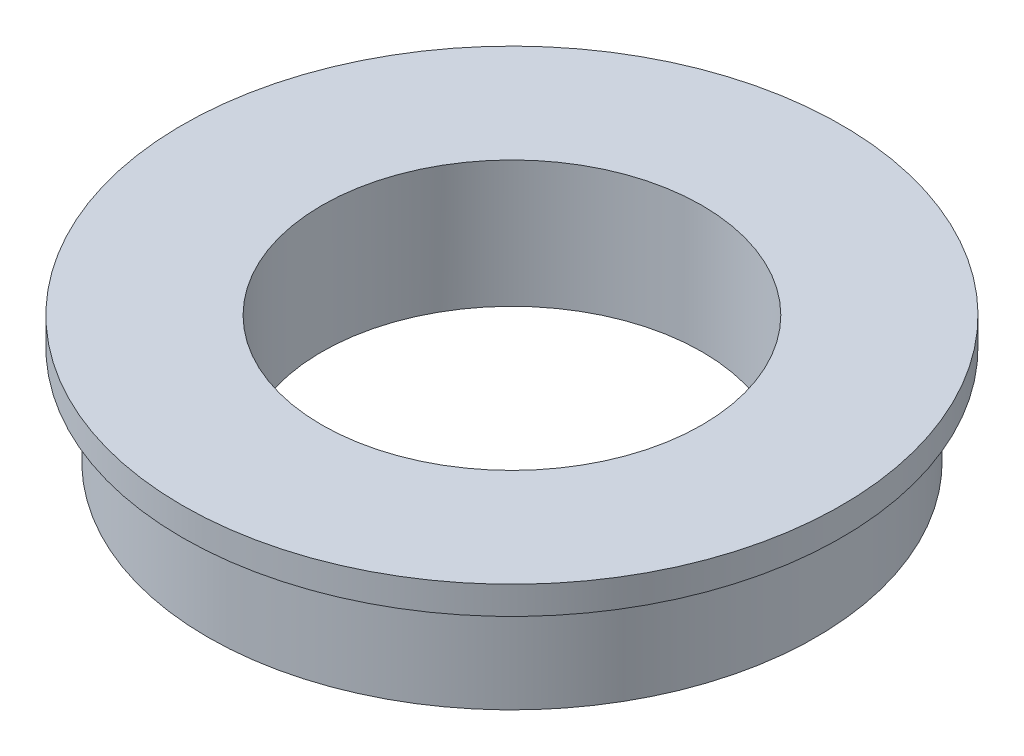
ISO-10303-21;
HEADER;
FILE_DESCRIPTION(('STEP AP214'),'2;1');
FILE_NAME('part.step','',(''),(''),'','','');
FILE_SCHEMA(('AUTOMOTIVE_DESIGN { 1 0 10303 214 1 1 1 1 }'));
ENDSEC;
DATA;
#1=APPLICATION_CONTEXT('core data for automotive mechanical design processes');
#2=APPLICATION_PROTOCOL_DEFINITION('international standard','automotive_design',2000,#1);
#3=PRODUCT_CONTEXT('',#1,'mechanical');
#4=PRODUCT('Part','Part','',(#3));
#5=PRODUCT_RELATED_PRODUCT_CATEGORY('part','',(#4));
#6=PRODUCT_DEFINITION_FORMATION('','',#4);
#7=PRODUCT_DEFINITION_CONTEXT('part definition',#1,'design');
#8=PRODUCT_DEFINITION('design','',#6,#7);
#9=PRODUCT_DEFINITION_SHAPE('','',#8);
#10=(LENGTH_UNIT() NAMED_UNIT(*) SI_UNIT(.MILLI.,.METRE.));
#11=(NAMED_UNIT(*) PLANE_ANGLE_UNIT() SI_UNIT($,.RADIAN.));
#12=(NAMED_UNIT(*) SI_UNIT($,.STERADIAN.) SOLID_ANGLE_UNIT());
#13=UNCERTAINTY_MEASURE_WITH_UNIT(LENGTH_MEASURE(1.E-05),#10,'distance_accuracy_value','');
#14=(GEOMETRIC_REPRESENTATION_CONTEXT(3) GLOBAL_UNCERTAINTY_ASSIGNED_CONTEXT((#13)) GLOBAL_UNIT_ASSIGNED_CONTEXT((#10,
#11,#12)) REPRESENTATION_CONTEXT('',''));
#15=CARTESIAN_POINT('',(0.,0.,0.));
#16=DIRECTION('',(0.,0.,1.));
#17=DIRECTION('',(1.,0.,0.));
#18=AXIS2_PLACEMENT_3D('',#15,#16,#17);
#19=CARTESIAN_POINT('',(0.,3.9,0.));
#20=DIRECTION('',(0.,-1.,0.));
#21=DIRECTION('',(0.,0.,-1.));
#22=AXIS2_PLACEMENT_3D('',#19,#20,#21);
#23=CYLINDRICAL_SURFACE('',#22,12.);
#24=CARTESIAN_POINT('',(0.,3.9,0.));
#25=DIRECTION('',(0.,1.,0.));
#26=DIRECTION('',(0.,0.,1.));
#27=AXIS2_PLACEMENT_3D('',#24,#25,#26);
#28=CIRCLE('',#27,12.);
#29=CARTESIAN_POINT('',(0.,3.9,12.));
#30=VERTEX_POINT('',#29);
#31=EDGE_CURVE('E10',#30,#30,#28,.T.);
#32=ORIENTED_EDGE('',*,*,#31,.F.);
#33=EDGE_LOOP('',(#32));
#34=FACE_BOUND('',#33,.T.);
#35=CARTESIAN_POINT('',(0.,0.,0.));
#36=DIRECTION('',(0.,1.,0.));
#37=DIRECTION('',(0.,0.,1.));
#38=AXIS2_PLACEMENT_3D('',#35,#36,#37);
#39=CIRCLE('',#38,12.);
#40=CARTESIAN_POINT('',(0.,0.,12.));
#41=VERTEX_POINT('',#40);
#42=EDGE_CURVE('E35',#41,#41,#39,.T.);
#43=ORIENTED_EDGE('',*,*,#42,.T.);
#44=EDGE_LOOP('',(#43));
#45=FACE_BOUND('',#44,.T.);
#46=ADVANCED_FACE('F32',(#34,#45),#23,.T.);
#47=CARTESIAN_POINT('',(0.,0.,0.));
#48=DIRECTION('',(0.,1.,0.));
#49=DIRECTION('',(0.,0.,1.));
#50=AXIS2_PLACEMENT_3D('',#47,#48,#49);
#51=PLANE('',#50);
#52=CARTESIAN_POINT('',(0.,0.,0.));
#53=DIRECTION('',(0.,-1.,0.));
#54=DIRECTION('',(0.,0.,-1.));
#55=AXIS2_PLACEMENT_3D('',#52,#53,#54);
#56=CIRCLE('',#55,7.5);
#57=CARTESIAN_POINT('',(0.,0.,-7.5));
#58=VERTEX_POINT('',#57);
#59=EDGE_CURVE('E52',#58,#58,#56,.T.);
#60=ORIENTED_EDGE('',*,*,#59,.F.);
#61=EDGE_LOOP('',(#60));
#62=FACE_BOUND('',#61,.T.);
#63=ORIENTED_EDGE('',*,*,#42,.F.);
#64=EDGE_LOOP('',(#63));
#65=FACE_BOUND('',#64,.T.);
#66=ADVANCED_FACE('F59',(#62,#65),#51,.F.);
#67=CARTESIAN_POINT('',(0.,5.,0.));
#68=DIRECTION('',(0.,-1.,0.));
#69=DIRECTION('',(0.,0.,-1.));
#70=AXIS2_PLACEMENT_3D('',#67,#68,#69);
#71=CYLINDRICAL_SURFACE('',#70,13.);
#72=CARTESIAN_POINT('',(0.,5.,0.));
#73=DIRECTION('',(0.,1.,0.));
#74=DIRECTION('',(0.,0.,1.));
#75=AXIS2_PLACEMENT_3D('',#72,#73,#74);
#76=CIRCLE('',#75,13.);
#77=CARTESIAN_POINT('',(0.,5.,13.));
#78=VERTEX_POINT('',#77);
#79=EDGE_CURVE('E42',#78,#78,#76,.T.);
#80=ORIENTED_EDGE('',*,*,#79,.F.);
#81=EDGE_LOOP('',(#80));
#82=FACE_BOUND('',#81,.T.);
#83=CARTESIAN_POINT('',(0.,3.9,0.));
#84=DIRECTION('',(0.,1.,0.));
#85=DIRECTION('',(0.,0.,1.));
#86=AXIS2_PLACEMENT_3D('',#83,#84,#85);
#87=CIRCLE('',#86,13.);
#88=CARTESIAN_POINT('',(0.,3.9,13.));
#89=VERTEX_POINT('',#88);
#90=EDGE_CURVE('E44',#89,#89,#87,.T.);
#91=ORIENTED_EDGE('',*,*,#90,.T.);
#92=EDGE_LOOP('',(#91));
#93=FACE_BOUND('',#92,.T.);
#94=ADVANCED_FACE('F62',(#82,#93),#71,.T.);
#95=CARTESIAN_POINT('',(0.,5.,0.));
#96=DIRECTION('',(0.,1.,0.));
#97=DIRECTION('',(0.,0.,1.));
#98=AXIS2_PLACEMENT_3D('',#95,#96,#97);
#99=PLANE('',#98);
#100=CARTESIAN_POINT('',(0.,5.,0.));
#101=DIRECTION('',(0.,1.,0.));
#102=DIRECTION('',(0.,0.,1.));
#103=AXIS2_PLACEMENT_3D('',#100,#101,#102);
#104=CIRCLE('',#103,7.5);
#105=CARTESIAN_POINT('',(0.,5.,7.5));
#106=VERTEX_POINT('',#105);
#107=EDGE_CURVE('E47',#106,#106,#104,.F.);
#108=ORIENTED_EDGE('',*,*,#107,.T.);
#109=EDGE_LOOP('',(#108));
#110=FACE_BOUND('',#109,.T.);
#111=ORIENTED_EDGE('',*,*,#79,.T.);
#112=EDGE_LOOP('',(#111));
#113=FACE_BOUND('',#112,.T.);
#114=ADVANCED_FACE('F81',(#110,#113),#99,.T.);
#115=CARTESIAN_POINT('',(0.,3.9,0.));
#116=DIRECTION('',(0.,1.,0.));
#117=DIRECTION('',(0.,0.,1.));
#118=AXIS2_PLACEMENT_3D('',#115,#116,#117);
#119=PLANE('',#118);
#120=ORIENTED_EDGE('',*,*,#31,.T.);
#121=EDGE_LOOP('',(#120));
#122=FACE_BOUND('',#121,.T.);
#123=ORIENTED_EDGE('',*,*,#90,.F.);
#124=EDGE_LOOP('',(#123));
#125=FACE_BOUND('',#124,.T.);
#126=ADVANCED_FACE('F88',(#122,#125),#119,.F.);
#127=CARTESIAN_POINT('',(0.,26.2132034355964,0.));
#128=DIRECTION('',(0.,-1.,0.));
#129=DIRECTION('',(0.,0.,-1.));
#130=AXIS2_PLACEMENT_3D('',#127,#128,#129);
#131=CYLINDRICAL_SURFACE('',#130,7.5);
#132=ORIENTED_EDGE('',*,*,#59,.T.);
#133=EDGE_LOOP('',(#132));
#134=FACE_BOUND('',#133,.T.);
#135=ORIENTED_EDGE('',*,*,#107,.F.);
#136=EDGE_LOOP('',(#135));
#137=FACE_BOUND('',#136,.T.);
#138=ADVANCED_FACE('F56',(#134,#137),#131,.F.);
#139=CLOSED_SHELL('',(#46,#66,#94,#114,#126,#138));
#140=MANIFOLD_SOLID_BREP('B2',#139);
#141=ADVANCED_BREP_SHAPE_REPRESENTATION('',(#18,#140),#14);
#142=SHAPE_DEFINITION_REPRESENTATION(#9,#141);
ENDSEC;
END-ISO-10303-21;
